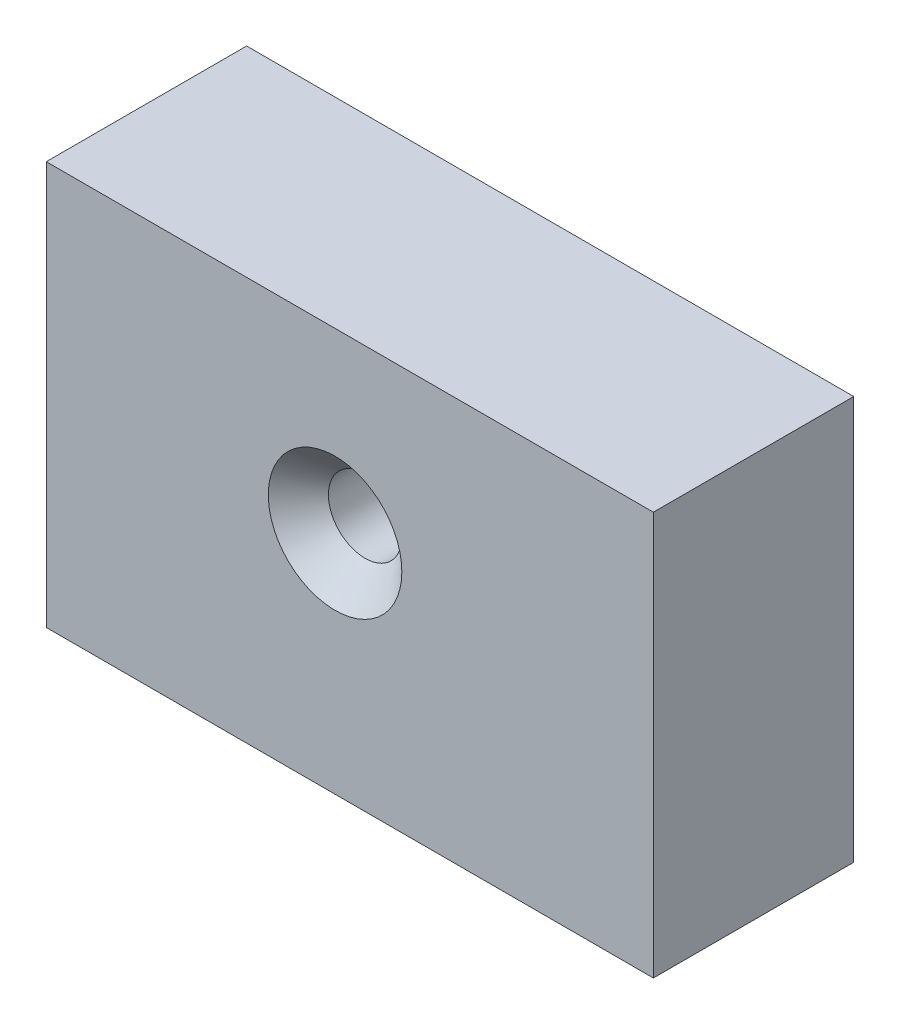
ISO-10303-21;
HEADER;
FILE_DESCRIPTION(('STEP AP214'),'2;1');
FILE_NAME('part.step','',(''),(''),'','','');
FILE_SCHEMA(('AUTOMOTIVE_DESIGN { 1 0 10303 214 1 1 1 1 }'));
ENDSEC;
DATA;
#1=APPLICATION_CONTEXT('core data for automotive mechanical design processes');
#2=APPLICATION_PROTOCOL_DEFINITION('international standard','automotive_design',2000,#1);
#3=PRODUCT_CONTEXT('',#1,'mechanical');
#4=PRODUCT('Part','Part','',(#3));
#5=PRODUCT_RELATED_PRODUCT_CATEGORY('part','',(#4));
#6=PRODUCT_DEFINITION_FORMATION('','',#4);
#7=PRODUCT_DEFINITION_CONTEXT('part definition',#1,'design');
#8=PRODUCT_DEFINITION('design','',#6,#7);
#9=PRODUCT_DEFINITION_SHAPE('','',#8);
#10=(LENGTH_UNIT() NAMED_UNIT(*) SI_UNIT(.MILLI.,.METRE.));
#11=(NAMED_UNIT(*) PLANE_ANGLE_UNIT() SI_UNIT($,.RADIAN.));
#12=(NAMED_UNIT(*) SI_UNIT($,.STERADIAN.) SOLID_ANGLE_UNIT());
#13=UNCERTAINTY_MEASURE_WITH_UNIT(LENGTH_MEASURE(1.E-05),#10,'distance_accuracy_value','');
#14=(GEOMETRIC_REPRESENTATION_CONTEXT(3) GLOBAL_UNCERTAINTY_ASSIGNED_CONTEXT((#13)) GLOBAL_UNIT_ASSIGNED_CONTEXT((#10,
#11,#12)) REPRESENTATION_CONTEXT('',''));
#15=CARTESIAN_POINT('',(0.,0.,0.));
#16=DIRECTION('',(0.,0.,1.));
#17=DIRECTION('',(1.,0.,0.));
#18=AXIS2_PLACEMENT_3D('',#15,#16,#17);
#19=CARTESIAN_POINT('',(-29.1205385746758,26.5626534296029,30.));
#20=DIRECTION('',(1.,0.,0.));
#21=DIRECTION('',(0.,0.,-1.));
#22=AXIS2_PLACEMENT_3D('',#19,#20,#21);
#23=PLANE('',#22);
#24=DIRECTION('',(0.,-1.,0.));
#25=VECTOR('',#24,1.);
#26=CARTESIAN_POINT('',(-29.1205385746758,26.5626534296029,0.));
#27=LINE('',#26,#25);
#28=CARTESIAN_POINT('',(-29.1205385746758,26.5626534296029,0.));
#29=VERTEX_POINT('',#28);
#30=CARTESIAN_POINT('',(-29.1205385746758,-33.8427880732718,0.));
#31=VERTEX_POINT('',#30);
#32=EDGE_CURVE('E100',#29,#31,#27,.T.);
#33=ORIENTED_EDGE('',*,*,#32,.T.);
#34=DIRECTION('',(0.,0.,-1.));
#35=VECTOR('',#34,1.);
#36=CARTESIAN_POINT('',(-29.1205385746758,-33.8427880732718,30.));
#37=LINE('',#36,#35);
#38=CARTESIAN_POINT('',(-29.1205385746758,-33.8427880732718,30.));
#39=VERTEX_POINT('',#38);
#40=EDGE_CURVE('E11',#39,#31,#37,.T.);
#41=ORIENTED_EDGE('',*,*,#40,.F.);
#42=DIRECTION('',(0.,-1.,0.));
#43=VECTOR('',#42,1.);
#44=CARTESIAN_POINT('',(-29.1205385746758,26.5626534296029,30.));
#45=LINE('',#44,#43);
#46=CARTESIAN_POINT('',(-29.1205385746758,26.5626534296029,30.));
#47=VERTEX_POINT('',#46);
#48=EDGE_CURVE('E111',#47,#39,#45,.T.);
#49=ORIENTED_EDGE('',*,*,#48,.F.);
#50=DIRECTION('',(0.,0.,-1.));
#51=VECTOR('',#50,1.);
#52=CARTESIAN_POINT('',(-29.1205385746758,26.5626534296029,30.));
#53=LINE('',#52,#51);
#54=EDGE_CURVE('E116',#47,#29,#53,.T.);
#55=ORIENTED_EDGE('',*,*,#54,.T.);
#56=EDGE_LOOP('',(#33,#41,#49,#55));
#57=FACE_BOUND('',#56,.T.);
#58=ADVANCED_FACE('F39',(#57),#23,.F.);
#59=CARTESIAN_POINT('',(-29.1205385746758,-33.8427880732718,30.));
#60=DIRECTION('',(0.,1.,0.));
#61=DIRECTION('',(0.,0.,1.));
#62=AXIS2_PLACEMENT_3D('',#59,#60,#61);
#63=PLANE('',#62);
#64=DIRECTION('',(1.,0.,0.));
#65=VECTOR('',#64,1.);
#66=CARTESIAN_POINT('',(-29.1205385746758,-33.8427880732718,0.));
#67=LINE('',#66,#65);
#68=CARTESIAN_POINT('',(61.7827642732986,-33.8427880732718,0.));
#69=VERTEX_POINT('',#68);
#70=EDGE_CURVE('E104',#31,#69,#67,.T.);
#71=ORIENTED_EDGE('',*,*,#70,.T.);
#72=DIRECTION('',(0.,0.,-1.));
#73=VECTOR('',#72,1.);
#74=CARTESIAN_POINT('',(61.7827642732986,-33.8427880732718,30.));
#75=LINE('',#74,#73);
#76=CARTESIAN_POINT('',(61.7827642732986,-33.8427880732718,30.));
#77=VERTEX_POINT('',#76);
#78=EDGE_CURVE('E47',#77,#69,#75,.T.);
#79=ORIENTED_EDGE('',*,*,#78,.F.);
#80=DIRECTION('',(1.,0.,0.));
#81=VECTOR('',#80,1.);
#82=CARTESIAN_POINT('',(-29.1205385746758,-33.8427880732718,30.));
#83=LINE('',#82,#81);
#84=EDGE_CURVE('E86',#39,#77,#83,.T.);
#85=ORIENTED_EDGE('',*,*,#84,.F.);
#86=ORIENTED_EDGE('',*,*,#40,.T.);
#87=EDGE_LOOP('',(#71,#79,#85,#86));
#88=FACE_BOUND('',#87,.T.);
#89=ADVANCED_FACE('F140',(#88),#63,.F.);
#90=CARTESIAN_POINT('',(61.7827642732986,26.5626534296029,30.));
#91=DIRECTION('',(-1.,0.,0.));
#92=DIRECTION('',(0.,0.,1.));
#93=AXIS2_PLACEMENT_3D('',#90,#91,#92);
#94=PLANE('',#93);
#95=DIRECTION('',(0.,1.,0.));
#96=VECTOR('',#95,1.);
#97=CARTESIAN_POINT('',(61.7827642732986,26.5626534296029,0.));
#98=LINE('',#97,#96);
#99=CARTESIAN_POINT('',(61.7827642732986,26.5626534296029,0.));
#100=VERTEX_POINT('',#99);
#101=EDGE_CURVE('E73',#69,#100,#98,.T.);
#102=ORIENTED_EDGE('',*,*,#101,.T.);
#103=DIRECTION('',(0.,0.,-1.));
#104=VECTOR('',#103,1.);
#105=CARTESIAN_POINT('',(61.7827642732986,26.5626534296029,30.));
#106=LINE('',#105,#104);
#107=CARTESIAN_POINT('',(61.7827642732986,26.5626534296029,30.));
#108=VERTEX_POINT('',#107);
#109=EDGE_CURVE('E122',#108,#100,#106,.T.);
#110=ORIENTED_EDGE('',*,*,#109,.F.);
#111=DIRECTION('',(0.,1.,0.));
#112=VECTOR('',#111,1.);
#113=CARTESIAN_POINT('',(61.7827642732986,26.5626534296029,30.));
#114=LINE('',#113,#112);
#115=EDGE_CURVE('E114',#77,#108,#114,.T.);
#116=ORIENTED_EDGE('',*,*,#115,.F.);
#117=ORIENTED_EDGE('',*,*,#78,.T.);
#118=EDGE_LOOP('',(#102,#110,#116,#117));
#119=FACE_BOUND('',#118,.T.);
#120=ADVANCED_FACE('F124',(#119),#94,.F.);
#121=CARTESIAN_POINT('',(-29.1205385746758,26.5626534296029,30.));
#122=DIRECTION('',(0.,-1.,0.));
#123=DIRECTION('',(0.,0.,-1.));
#124=AXIS2_PLACEMENT_3D('',#121,#122,#123);
#125=PLANE('',#124);
#126=DIRECTION('',(-1.,0.,0.));
#127=VECTOR('',#126,1.);
#128=CARTESIAN_POINT('',(-29.1205385746758,26.5626534296029,0.));
#129=LINE('',#128,#127);
#130=EDGE_CURVE('E79',#100,#29,#129,.T.);
#131=ORIENTED_EDGE('',*,*,#130,.T.);
#132=ORIENTED_EDGE('',*,*,#54,.F.);
#133=DIRECTION('',(-1.,0.,0.));
#134=VECTOR('',#133,1.);
#135=CARTESIAN_POINT('',(-29.1205385746758,26.5626534296029,30.));
#136=LINE('',#135,#134);
#137=EDGE_CURVE('E55',#108,#47,#136,.T.);
#138=ORIENTED_EDGE('',*,*,#137,.F.);
#139=ORIENTED_EDGE('',*,*,#109,.T.);
#140=EDGE_LOOP('',(#131,#132,#138,#139));
#141=FACE_BOUND('',#140,.T.);
#142=ADVANCED_FACE('F130',(#141),#125,.F.);
#143=CARTESIAN_POINT('',(0.,0.,30.));
#144=DIRECTION('',(0.,0.,1.));
#145=DIRECTION('',(1.,0.,0.));
#146=AXIS2_PLACEMENT_3D('',#143,#144,#145);
#147=PLANE('',#146);
#148=CARTESIAN_POINT('',(14.1202142280991,0.,30.));
#149=DIRECTION('',(0.,0.,1.));
#150=DIRECTION('',(1.,0.,0.));
#151=AXIS2_PLACEMENT_3D('',#148,#149,#150);
#152=CIRCLE('',#151,10.);
#153=CARTESIAN_POINT('',(24.1202142280991,0.,30.));
#154=VERTEX_POINT('',#153);
#155=EDGE_CURVE('E107',#154,#154,#152,.T.);
#156=ORIENTED_EDGE('',*,*,#155,.F.);
#157=EDGE_LOOP('',(#156));
#158=FACE_BOUND('',#157,.T.);
#159=ORIENTED_EDGE('',*,*,#48,.T.);
#160=ORIENTED_EDGE('',*,*,#84,.T.);
#161=ORIENTED_EDGE('',*,*,#115,.T.);
#162=ORIENTED_EDGE('',*,*,#137,.T.);
#163=EDGE_LOOP('',(#159,#160,#161,#162));
#164=FACE_BOUND('',#163,.T.);
#165=ADVANCED_FACE('F132',(#158,#164),#147,.T.);
#166=CARTESIAN_POINT('',(0.,0.,0.));
#167=DIRECTION('',(0.,0.,1.));
#168=DIRECTION('',(1.,0.,0.));
#169=AXIS2_PLACEMENT_3D('',#166,#167,#168);
#170=PLANE('',#169);
#171=ORIENTED_EDGE('',*,*,#32,.F.);
#172=ORIENTED_EDGE('',*,*,#130,.F.);
#173=ORIENTED_EDGE('',*,*,#101,.F.);
#174=ORIENTED_EDGE('',*,*,#70,.F.);
#175=EDGE_LOOP('',(#171,#172,#173,#174));
#176=FACE_BOUND('',#175,.T.);
#177=ADVANCED_FACE('F94',(#176),#170,.F.);
#178=CARTESIAN_POINT('',(14.1202142280991,0.,4.99999999999999));
#179=DIRECTION('',(0.,0.,1.));
#180=DIRECTION('',(1.,0.,0.));
#181=AXIS2_PLACEMENT_3D('',#178,#179,#180);
#182=CONICAL_SURFACE('',#181,5.49999999999998,1.02974425867665);
#183=CARTESIAN_POINT('',(14.1202142280991,0.,1.69526659534842));
#184=VERTEX_POINT('',#183);
#185=VERTEX_LOOP('',#184);
#186=FACE_BOUND('',#185,.T.);
#187=CARTESIAN_POINT('',(14.1202142280991,0.,4.99999999999999));
#188=DIRECTION('',(0.,0.,1.));
#189=DIRECTION('',(1.,0.,0.));
#190=AXIS2_PLACEMENT_3D('',#187,#188,#189);
#191=CIRCLE('',#190,5.49999999999998);
#192=CARTESIAN_POINT('',(19.6202142280991,0.,4.99999999999999));
#193=VERTEX_POINT('',#192);
#194=EDGE_CURVE('E98',#193,#193,#191,.T.);
#195=ORIENTED_EDGE('',*,*,#194,.T.);
#196=EDGE_LOOP('',(#195));
#197=FACE_BOUND('',#196,.T.);
#198=ADVANCED_FACE('F90',(#186,#197),#182,.F.);
#199=CARTESIAN_POINT('',(14.1202142280991,0.,30.));
#200=DIRECTION('',(0.,0.,1.));
#201=DIRECTION('',(1.,0.,0.));
#202=AXIS2_PLACEMENT_3D('',#199,#200,#201);
#203=CYLINDRICAL_SURFACE('',#202,5.49999999999999);
#204=ORIENTED_EDGE('',*,*,#194,.F.);
#205=EDGE_LOOP('',(#204));
#206=FACE_BOUND('',#205,.T.);
#207=CARTESIAN_POINT('',(14.1202142280991,0.,25.5));
#208=DIRECTION('',(0.,0.,1.));
#209=DIRECTION('',(1.,0.,0.));
#210=AXIS2_PLACEMENT_3D('',#207,#208,#209);
#211=CIRCLE('',#210,5.5);
#212=CARTESIAN_POINT('',(19.6202142280991,0.,25.5));
#213=VERTEX_POINT('',#212);
#214=EDGE_CURVE('E101',#213,#213,#211,.T.);
#215=ORIENTED_EDGE('',*,*,#214,.T.);
#216=EDGE_LOOP('',(#215));
#217=FACE_BOUND('',#216,.T.);
#218=ADVANCED_FACE('F93',(#206,#217),#203,.F.);
#219=CARTESIAN_POINT('',(14.1202142280991,0.,30.));
#220=DIRECTION('',(0.,0.,1.));
#221=DIRECTION('',(1.,0.,0.));
#222=AXIS2_PLACEMENT_3D('',#219,#220,#221);
#223=CONICAL_SURFACE('',#222,10.,0.785398163397449);
#224=ORIENTED_EDGE('',*,*,#214,.F.);
#225=EDGE_LOOP('',(#224));
#226=FACE_BOUND('',#225,.T.);
#227=ORIENTED_EDGE('',*,*,#155,.T.);
#228=EDGE_LOOP('',(#227));
#229=FACE_BOUND('',#228,.T.);
#230=ADVANCED_FACE('F187',(#226,#229),#223,.F.);
#231=CLOSED_SHELL('',(#58,#89,#120,#142,#165,#177,#198,#218,#230));
#232=MANIFOLD_SOLID_BREP('B2',#231);
#233=ADVANCED_BREP_SHAPE_REPRESENTATION('',(#18,#232),#14);
#234=SHAPE_DEFINITION_REPRESENTATION(#9,#233);
ENDSEC;
END-ISO-10303-21;
